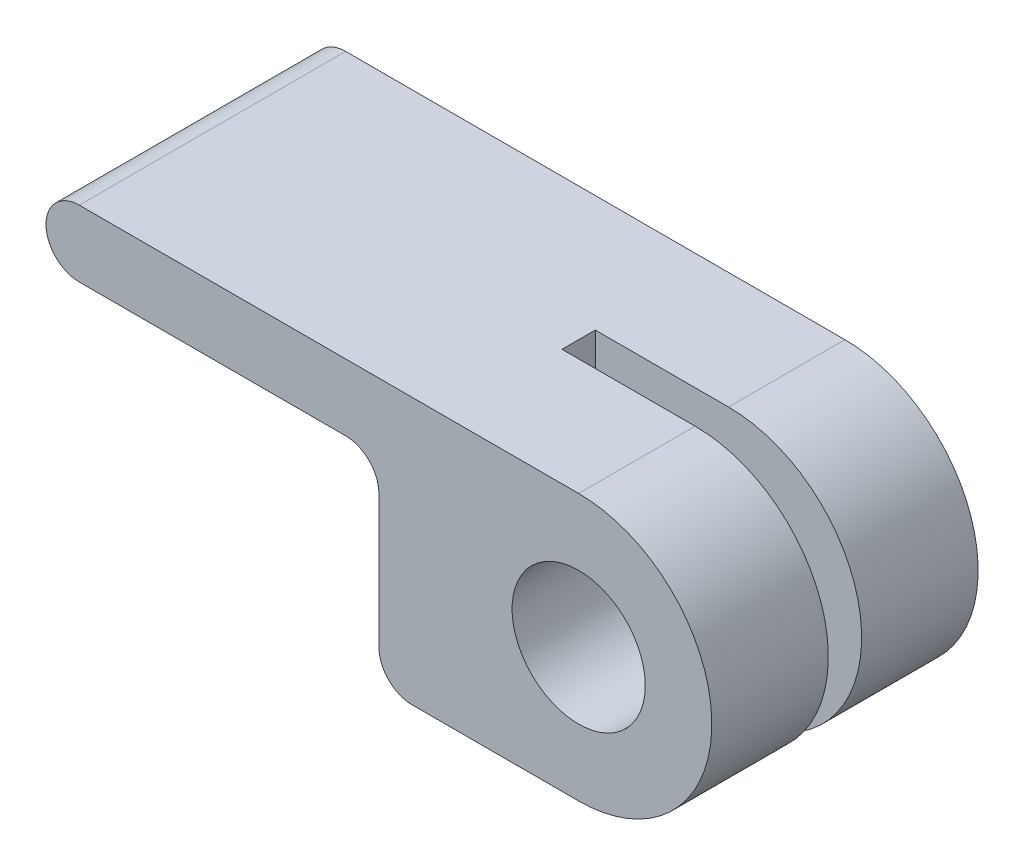
ISO-10303-21;
HEADER;
FILE_DESCRIPTION(('STEP AP214'),'2;1');
FILE_NAME('part.step','',(''),(''),'','','');
FILE_SCHEMA(('AUTOMOTIVE_DESIGN { 1 0 10303 214 1 1 1 1 }'));
ENDSEC;
DATA;
#1=APPLICATION_CONTEXT('core data for automotive mechanical design processes');
#2=APPLICATION_PROTOCOL_DEFINITION('international standard','automotive_design',2000,#1);
#3=PRODUCT_CONTEXT('',#1,'mechanical');
#4=PRODUCT('Part','Part','',(#3));
#5=PRODUCT_RELATED_PRODUCT_CATEGORY('part','',(#4));
#6=PRODUCT_DEFINITION_FORMATION('','',#4);
#7=PRODUCT_DEFINITION_CONTEXT('part definition',#1,'design');
#8=PRODUCT_DEFINITION('design','',#6,#7);
#9=PRODUCT_DEFINITION_SHAPE('','',#8);
#10=(LENGTH_UNIT() NAMED_UNIT(*) SI_UNIT(.MILLI.,.METRE.));
#11=(NAMED_UNIT(*) PLANE_ANGLE_UNIT() SI_UNIT($,.RADIAN.));
#12=(NAMED_UNIT(*) SI_UNIT($,.STERADIAN.) SOLID_ANGLE_UNIT());
#13=UNCERTAINTY_MEASURE_WITH_UNIT(LENGTH_MEASURE(1.E-05),#10,'distance_accuracy_value','');
#14=(GEOMETRIC_REPRESENTATION_CONTEXT(3) GLOBAL_UNCERTAINTY_ASSIGNED_CONTEXT((#13)) GLOBAL_UNIT_ASSIGNED_CONTEXT((#10,
#11,#12)) REPRESENTATION_CONTEXT('',''));
#15=CARTESIAN_POINT('',(0.,0.,0.));
#16=DIRECTION('',(0.,0.,1.));
#17=DIRECTION('',(1.,0.,0.));
#18=AXIS2_PLACEMENT_3D('',#15,#16,#17);
#19=CARTESIAN_POINT('',(0.,-6.35,12.7));
#20=DIRECTION('',(0.,1.,0.));
#21=DIRECTION('',(-1.,0.,0.));
#22=AXIS2_PLACEMENT_3D('',#19,#20,#21);
#23=PLANE('',#22);
#24=DIRECTION('',(1.,0.,0.));
#25=VECTOR('',#24,1.);
#26=CARTESIAN_POINT('',(0.,-6.35,12.7));
#27=LINE('',#26,#25);
#28=CARTESIAN_POINT('',(-7.9375,-6.35,12.7));
#29=VERTEX_POINT('',#28);
#30=CARTESIAN_POINT('',(0.,-6.35,12.7));
#31=VERTEX_POINT('',#30);
#32=EDGE_CURVE('E174',#29,#31,#27,.T.);
#33=ORIENTED_EDGE('',*,*,#32,.F.);
#34=DIRECTION('',(0.,0.,-1.));
#35=VECTOR('',#34,1.);
#36=CARTESIAN_POINT('',(-7.9375,-6.35,12.7));
#37=LINE('',#36,#35);
#38=CARTESIAN_POINT('',(-7.9375,-6.35,0.));
#39=VERTEX_POINT('',#38);
#40=EDGE_CURVE('E225',#29,#39,#37,.T.);
#41=ORIENTED_EDGE('',*,*,#40,.T.);
#42=DIRECTION('',(1.,0.,0.));
#43=VECTOR('',#42,1.);
#44=CARTESIAN_POINT('',(0.,-6.35,0.));
#45=LINE('',#44,#43);
#46=CARTESIAN_POINT('',(0.,-6.35,0.));
#47=VERTEX_POINT('',#46);
#48=EDGE_CURVE('E173',#39,#47,#45,.T.);
#49=ORIENTED_EDGE('',*,*,#48,.T.);
#50=DIRECTION('',(0.,0.,-1.));
#51=VECTOR('',#50,1.);
#52=CARTESIAN_POINT('',(0.,-6.35,12.7));
#53=LINE('',#52,#51);
#54=CARTESIAN_POINT('',(0.,-6.35,5.55625));
#55=VERTEX_POINT('',#54);
#56=EDGE_CURVE('E157',#55,#47,#53,.T.);
#57=ORIENTED_EDGE('',*,*,#56,.F.);
#58=DIRECTION('',(1.,0.,0.));
#59=VECTOR('',#58,1.);
#60=CARTESIAN_POINT('',(6.35,-6.35,5.55625));
#61=LINE('',#60,#59);
#62=CARTESIAN_POINT('',(-6.35,-6.35,5.55625));
#63=VERTEX_POINT('',#62);
#64=EDGE_CURVE('E150',#63,#55,#61,.T.);
#65=ORIENTED_EDGE('',*,*,#64,.F.);
#66=DIRECTION('',(0.,0.,1.));
#67=VECTOR('',#66,1.);
#68=CARTESIAN_POINT('',(-6.35,-6.35,5.55625));
#69=LINE('',#68,#67);
#70=CARTESIAN_POINT('',(-6.35,-6.35,7.14375));
#71=VERTEX_POINT('',#70);
#72=EDGE_CURVE('E134',#63,#71,#69,.T.);
#73=ORIENTED_EDGE('',*,*,#72,.T.);
#74=DIRECTION('',(1.,0.,0.));
#75=VECTOR('',#74,1.);
#76=CARTESIAN_POINT('',(6.35,-6.35,7.14375));
#77=LINE('',#76,#75);
#78=CARTESIAN_POINT('',(0.,-6.35,7.14375));
#79=VERTEX_POINT('',#78);
#80=EDGE_CURVE('E162',#71,#79,#77,.T.);
#81=ORIENTED_EDGE('',*,*,#80,.T.);
#82=EDGE_CURVE('E209',#31,#79,#53,.T.);
#83=ORIENTED_EDGE('',*,*,#82,.F.);
#84=EDGE_LOOP('',(#33,#41,#49,#57,#65,#73,#81,#83));
#85=FACE_BOUND('',#84,.T.);
#86=ADVANCED_FACE('F38',(#85),#23,.F.);
#87=CARTESIAN_POINT('',(0.,0.,12.7));
#88=DIRECTION('',(0.,0.,-1.));
#89=DIRECTION('',(-1.,0.,0.));
#90=AXIS2_PLACEMENT_3D('',#87,#88,#89);
#91=CYLINDRICAL_SURFACE('',#90,6.35);
#92=CARTESIAN_POINT('',(0.,0.,5.55625));
#93=DIRECTION('',(0.,0.,1.));
#94=DIRECTION('',(1.,0.,0.));
#95=AXIS2_PLACEMENT_3D('',#92,#93,#94);
#96=CIRCLE('',#95,6.35);
#97=CARTESIAN_POINT('',(0.,6.35,5.55625));
#98=VERTEX_POINT('',#97);
#99=EDGE_CURVE('E171',#55,#98,#96,.T.);
#100=ORIENTED_EDGE('',*,*,#99,.F.);
#101=ORIENTED_EDGE('',*,*,#56,.T.);
#102=CARTESIAN_POINT('',(0.,0.,0.));
#103=DIRECTION('',(0.,0.,1.));
#104=DIRECTION('',(1.,0.,0.));
#105=AXIS2_PLACEMENT_3D('',#102,#103,#104);
#106=CIRCLE('',#105,6.35);
#107=CARTESIAN_POINT('',(0.,6.35,0.));
#108=VERTEX_POINT('',#107);
#109=EDGE_CURVE('E193',#47,#108,#106,.T.);
#110=ORIENTED_EDGE('',*,*,#109,.T.);
#111=DIRECTION('',(0.,0.,-1.));
#112=VECTOR('',#111,1.);
#113=CARTESIAN_POINT('',(0.,6.35,12.7));
#114=LINE('',#113,#112);
#115=EDGE_CURVE('E191',#98,#108,#114,.T.);
#116=ORIENTED_EDGE('',*,*,#115,.F.);
#117=EDGE_LOOP('',(#100,#101,#110,#116));
#118=FACE_BOUND('',#117,.T.);
#119=ADVANCED_FACE('F289',(#118),#91,.T.);
#120=CARTESIAN_POINT('',(0.,6.35,12.7));
#121=DIRECTION('',(0.,1.,0.));
#122=DIRECTION('',(0.,0.,1.));
#123=AXIS2_PLACEMENT_3D('',#120,#121,#122);
#124=PLANE('',#123);
#125=DIRECTION('',(1.,0.,0.));
#126=VECTOR('',#125,1.);
#127=CARTESIAN_POINT('',(0.,6.35,0.));
#128=LINE('',#127,#126);
#129=CARTESIAN_POINT('',(-23.8125,6.35,0.));
#130=VERTEX_POINT('',#129);
#131=EDGE_CURVE('E196',#130,#108,#128,.T.);
#132=ORIENTED_EDGE('',*,*,#131,.F.);
#133=DIRECTION('',(0.,0.,-1.));
#134=VECTOR('',#133,1.);
#135=CARTESIAN_POINT('',(-23.8125,6.35,12.7));
#136=LINE('',#135,#134);
#137=CARTESIAN_POINT('',(-23.8125,6.35,12.7));
#138=VERTEX_POINT('',#137);
#139=EDGE_CURVE('E239',#130,#138,#136,.F.);
#140=ORIENTED_EDGE('',*,*,#139,.T.);
#141=DIRECTION('',(1.,0.,0.));
#142=VECTOR('',#141,1.);
#143=CARTESIAN_POINT('',(0.,6.35,12.7));
#144=LINE('',#143,#142);
#145=CARTESIAN_POINT('',(0.,6.35,12.7));
#146=VERTEX_POINT('',#145);
#147=EDGE_CURVE('E180',#138,#146,#144,.T.);
#148=ORIENTED_EDGE('',*,*,#147,.T.);
#149=CARTESIAN_POINT('',(0.,6.35,7.14375));
#150=VERTEX_POINT('',#149);
#151=EDGE_CURVE('E206',#146,#150,#114,.T.);
#152=ORIENTED_EDGE('',*,*,#151,.T.);
#153=DIRECTION('',(-1.,0.,0.));
#154=VECTOR('',#153,1.);
#155=CARTESIAN_POINT('',(6.35,6.35,7.14375));
#156=LINE('',#155,#154);
#157=CARTESIAN_POINT('',(-6.35,6.35,7.14375));
#158=VERTEX_POINT('',#157);
#159=EDGE_CURVE('E153',#150,#158,#156,.T.);
#160=ORIENTED_EDGE('',*,*,#159,.T.);
#161=DIRECTION('',(0.,0.,1.));
#162=VECTOR('',#161,1.);
#163=CARTESIAN_POINT('',(-6.35,6.35,5.55625));
#164=LINE('',#163,#162);
#165=CARTESIAN_POINT('',(-6.35,6.35,5.55625));
#166=VERTEX_POINT('',#165);
#167=EDGE_CURVE('E144',#166,#158,#164,.T.);
#168=ORIENTED_EDGE('',*,*,#167,.F.);
#169=DIRECTION('',(-1.,0.,0.));
#170=VECTOR('',#169,1.);
#171=CARTESIAN_POINT('',(6.35,6.35,5.55625));
#172=LINE('',#171,#170);
#173=EDGE_CURVE('E145',#98,#166,#172,.T.);
#174=ORIENTED_EDGE('',*,*,#173,.F.);
#175=ORIENTED_EDGE('',*,*,#115,.T.);
#176=EDGE_LOOP('',(#132,#140,#148,#152,#160,#168,#174,#175));
#177=FACE_BOUND('',#176,.T.);
#178=ADVANCED_FACE('F275',(#177),#124,.T.);
#179=CARTESIAN_POINT('',(0.,0.,12.7));
#180=DIRECTION('',(0.,0.,-1.));
#181=DIRECTION('',(-1.,0.,0.));
#182=AXIS2_PLACEMENT_3D('',#179,#180,#181);
#183=CYLINDRICAL_SURFACE('',#182,3.175);
#184=CARTESIAN_POINT('',(0.,0.,0.));
#185=DIRECTION('',(0.,0.,1.));
#186=DIRECTION('',(1.,0.,0.));
#187=AXIS2_PLACEMENT_3D('',#184,#185,#186);
#188=CIRCLE('',#187,3.175);
#189=CARTESIAN_POINT('',(3.175,0.,0.));
#190=VERTEX_POINT('',#189);
#191=EDGE_CURVE('E177',#190,#190,#188,.T.);
#192=ORIENTED_EDGE('',*,*,#191,.F.);
#193=EDGE_LOOP('',(#192));
#194=FACE_BOUND('',#193,.T.);
#195=CARTESIAN_POINT('',(0.,0.,5.55625));
#196=DIRECTION('',(0.,0.,1.));
#197=DIRECTION('',(1.,0.,0.));
#198=AXIS2_PLACEMENT_3D('',#195,#196,#197);
#199=CIRCLE('',#198,3.175);
#200=CARTESIAN_POINT('',(3.175,0.,5.55625));
#201=VERTEX_POINT('',#200);
#202=EDGE_CURVE('E170',#201,#201,#199,.T.);
#203=ORIENTED_EDGE('',*,*,#202,.T.);
#204=EDGE_LOOP('',(#203));
#205=FACE_BOUND('',#204,.T.);
#206=ADVANCED_FACE('F319',(#194,#205),#183,.F.);
#207=CARTESIAN_POINT('',(0.,0.,7.14375));
#208=DIRECTION('',(0.,0.,1.));
#209=DIRECTION('',(1.,0.,0.));
#210=AXIS2_PLACEMENT_3D('',#207,#208,#209);
#211=CIRCLE('',#210,6.35);
#212=EDGE_CURVE('E168',#79,#150,#211,.T.);
#213=ORIENTED_EDGE('',*,*,#212,.T.);
#214=ORIENTED_EDGE('',*,*,#151,.F.);
#215=CARTESIAN_POINT('',(0.,0.,12.7));
#216=DIRECTION('',(0.,0.,1.));
#217=DIRECTION('',(1.,0.,0.));
#218=AXIS2_PLACEMENT_3D('',#215,#216,#217);
#219=CIRCLE('',#218,6.35);
#220=EDGE_CURVE('E176',#31,#146,#219,.T.);
#221=ORIENTED_EDGE('',*,*,#220,.F.);
#222=ORIENTED_EDGE('',*,*,#82,.T.);
#223=EDGE_LOOP('',(#213,#214,#221,#222));
#224=FACE_BOUND('',#223,.T.);
#225=ADVANCED_FACE('F270',(#224),#91,.T.);
#226=CARTESIAN_POINT('',(0.,3.175,12.7));
#227=DIRECTION('',(0.,-1.,0.));
#228=DIRECTION('',(1.,0.,0.));
#229=AXIS2_PLACEMENT_3D('',#226,#227,#228);
#230=PLANE('',#229);
#231=DIRECTION('',(-1.,0.,0.));
#232=VECTOR('',#231,1.);
#233=CARTESIAN_POINT('',(0.,3.175,0.));
#234=LINE('',#233,#232);
#235=CARTESIAN_POINT('',(-11.1125,3.175,0.));
#236=VERTEX_POINT('',#235);
#237=CARTESIAN_POINT('',(-23.8125,3.175,0.));
#238=VERTEX_POINT('',#237);
#239=EDGE_CURVE('E198',#236,#238,#234,.T.);
#240=ORIENTED_EDGE('',*,*,#239,.F.);
#241=DIRECTION('',(0.,0.,-1.));
#242=VECTOR('',#241,1.);
#243=CARTESIAN_POINT('',(-11.1125,3.175,12.7));
#244=LINE('',#243,#242);
#245=CARTESIAN_POINT('',(-11.1125,3.175,12.7));
#246=VERTEX_POINT('',#245);
#247=EDGE_CURVE('E223',#236,#246,#244,.F.);
#248=ORIENTED_EDGE('',*,*,#247,.T.);
#249=DIRECTION('',(-1.,0.,0.));
#250=VECTOR('',#249,1.);
#251=CARTESIAN_POINT('',(0.,3.175,12.7));
#252=LINE('',#251,#250);
#253=CARTESIAN_POINT('',(-23.8125,3.175,12.7));
#254=VERTEX_POINT('',#253);
#255=EDGE_CURVE('E182',#246,#254,#252,.T.);
#256=ORIENTED_EDGE('',*,*,#255,.T.);
#257=DIRECTION('',(0.,0.,-1.));
#258=VECTOR('',#257,1.);
#259=CARTESIAN_POINT('',(-23.8125,3.175,12.7));
#260=LINE('',#259,#258);
#261=EDGE_CURVE('E221',#254,#238,#260,.T.);
#262=ORIENTED_EDGE('',*,*,#261,.T.);
#263=EDGE_LOOP('',(#240,#248,#256,#262));
#264=FACE_BOUND('',#263,.T.);
#265=ADVANCED_FACE('F252',(#264),#230,.T.);
#266=CARTESIAN_POINT('',(-9.525,0.,12.7));
#267=DIRECTION('',(1.,0.,0.));
#268=DIRECTION('',(0.,0.,-1.));
#269=AXIS2_PLACEMENT_3D('',#266,#267,#268);
#270=PLANE('',#269);
#271=DIRECTION('',(0.,-1.,0.));
#272=VECTOR('',#271,1.);
#273=CARTESIAN_POINT('',(-9.525,0.,12.7));
#274=LINE('',#273,#272);
#275=CARTESIAN_POINT('',(-9.525,1.5875,12.7));
#276=VERTEX_POINT('',#275);
#277=CARTESIAN_POINT('',(-9.525,-4.7625,12.7));
#278=VERTEX_POINT('',#277);
#279=EDGE_CURVE('E185',#276,#278,#274,.T.);
#280=ORIENTED_EDGE('',*,*,#279,.F.);
#281=DIRECTION('',(0.,0.,-1.));
#282=VECTOR('',#281,1.);
#283=CARTESIAN_POINT('',(-9.525,1.5875,12.7));
#284=LINE('',#283,#282);
#285=CARTESIAN_POINT('',(-9.525,1.5875,0.));
#286=VERTEX_POINT('',#285);
#287=EDGE_CURVE('E218',#276,#286,#284,.T.);
#288=ORIENTED_EDGE('',*,*,#287,.T.);
#289=DIRECTION('',(0.,-1.,0.));
#290=VECTOR('',#289,1.);
#291=CARTESIAN_POINT('',(-9.525,0.,0.));
#292=LINE('',#291,#290);
#293=CARTESIAN_POINT('',(-9.525,-4.7625,0.));
#294=VERTEX_POINT('',#293);
#295=EDGE_CURVE('E201',#286,#294,#292,.T.);
#296=ORIENTED_EDGE('',*,*,#295,.T.);
#297=DIRECTION('',(0.,0.,-1.));
#298=VECTOR('',#297,1.);
#299=CARTESIAN_POINT('',(-9.525,-4.7625,12.7));
#300=LINE('',#299,#298);
#301=EDGE_CURVE('E212',#294,#278,#300,.F.);
#302=ORIENTED_EDGE('',*,*,#301,.T.);
#303=EDGE_LOOP('',(#280,#288,#296,#302));
#304=FACE_BOUND('',#303,.T.);
#305=ADVANCED_FACE('F262',(#304),#270,.F.);
#306=CARTESIAN_POINT('',(0.,0.,7.14375));
#307=DIRECTION('',(0.,0.,1.));
#308=DIRECTION('',(1.,0.,0.));
#309=AXIS2_PLACEMENT_3D('',#306,#307,#308);
#310=CIRCLE('',#309,3.175);
#311=CARTESIAN_POINT('',(3.175,0.,7.14375));
#312=VERTEX_POINT('',#311);
#313=EDGE_CURVE('E166',#312,#312,#310,.T.);
#314=ORIENTED_EDGE('',*,*,#313,.F.);
#315=EDGE_LOOP('',(#314));
#316=FACE_BOUND('',#315,.T.);
#317=CARTESIAN_POINT('',(0.,0.,12.7));
#318=DIRECTION('',(0.,0.,1.));
#319=DIRECTION('',(1.,0.,0.));
#320=AXIS2_PLACEMENT_3D('',#317,#318,#319);
#321=CIRCLE('',#320,3.175);
#322=CARTESIAN_POINT('',(3.175,0.,12.7));
#323=VERTEX_POINT('',#322);
#324=EDGE_CURVE('E188',#323,#323,#321,.T.);
#325=ORIENTED_EDGE('',*,*,#324,.T.);
#326=EDGE_LOOP('',(#325));
#327=FACE_BOUND('',#326,.T.);
#328=ADVANCED_FACE('F313',(#316,#327),#183,.F.);
#329=CARTESIAN_POINT('',(0.,0.,12.7));
#330=DIRECTION('',(0.,0.,1.));
#331=DIRECTION('',(1.,0.,0.));
#332=AXIS2_PLACEMENT_3D('',#329,#330,#331);
#333=PLANE('',#332);
#334=ORIENTED_EDGE('',*,*,#279,.T.);
#335=CARTESIAN_POINT('',(-7.9375,-4.7625,12.7));
#336=DIRECTION('',(0.,0.,1.));
#337=DIRECTION('',(1.,0.,0.));
#338=AXIS2_PLACEMENT_3D('',#335,#336,#337);
#339=CIRCLE('',#338,1.5875);
#340=EDGE_CURVE('E237',#278,#29,#339,.T.);
#341=ORIENTED_EDGE('',*,*,#340,.T.);
#342=ORIENTED_EDGE('',*,*,#32,.T.);
#343=ORIENTED_EDGE('',*,*,#220,.T.);
#344=ORIENTED_EDGE('',*,*,#147,.F.);
#345=CARTESIAN_POINT('',(-23.8125,4.7625,12.7));
#346=DIRECTION('',(0.,0.,1.));
#347=DIRECTION('',(1.,0.,0.));
#348=AXIS2_PLACEMENT_3D('',#345,#346,#347);
#349=CIRCLE('',#348,1.5875);
#350=CARTESIAN_POINT('',(-25.4,4.7625,12.7));
#351=VERTEX_POINT('',#350);
#352=EDGE_CURVE('E54',#138,#351,#349,.T.);
#353=ORIENTED_EDGE('',*,*,#352,.T.);
#354=CARTESIAN_POINT('',(-23.8125,4.7625,12.7));
#355=DIRECTION('',(0.,0.,1.));
#356=DIRECTION('',(1.,0.,0.));
#357=AXIS2_PLACEMENT_3D('',#354,#355,#356);
#358=CIRCLE('',#357,1.5875);
#359=EDGE_CURVE('E234',#351,#254,#358,.T.);
#360=ORIENTED_EDGE('',*,*,#359,.T.);
#361=ORIENTED_EDGE('',*,*,#255,.F.);
#362=CARTESIAN_POINT('',(-11.1125,1.5875,12.7));
#363=DIRECTION('',(0.,0.,1.));
#364=DIRECTION('',(1.,0.,0.));
#365=AXIS2_PLACEMENT_3D('',#362,#363,#364);
#366=CIRCLE('',#365,1.5875);
#367=EDGE_CURVE('E11',#246,#276,#366,.F.);
#368=ORIENTED_EDGE('',*,*,#367,.T.);
#369=EDGE_LOOP('',(#334,#341,#342,#343,#344,#353,#360,#361,#368));
#370=FACE_BOUND('',#369,.T.);
#371=ORIENTED_EDGE('',*,*,#324,.F.);
#372=EDGE_LOOP('',(#371));
#373=FACE_BOUND('',#372,.T.);
#374=ADVANCED_FACE('F258',(#370,#373),#333,.T.);
#375=CARTESIAN_POINT('',(0.,0.,0.));
#376=DIRECTION('',(0.,0.,1.));
#377=DIRECTION('',(1.,0.,0.));
#378=AXIS2_PLACEMENT_3D('',#375,#376,#377);
#379=PLANE('',#378);
#380=ORIENTED_EDGE('',*,*,#48,.F.);
#381=CARTESIAN_POINT('',(-7.9375,-4.7625,0.));
#382=DIRECTION('',(0.,0.,1.));
#383=DIRECTION('',(1.,0.,0.));
#384=AXIS2_PLACEMENT_3D('',#381,#382,#383);
#385=CIRCLE('',#384,1.5875);
#386=EDGE_CURVE('E232',#39,#294,#385,.F.);
#387=ORIENTED_EDGE('',*,*,#386,.T.);
#388=ORIENTED_EDGE('',*,*,#295,.F.);
#389=CARTESIAN_POINT('',(-11.1125,1.5875,0.));
#390=DIRECTION('',(0.,0.,1.));
#391=DIRECTION('',(1.,0.,0.));
#392=AXIS2_PLACEMENT_3D('',#389,#390,#391);
#393=CIRCLE('',#392,1.5875);
#394=EDGE_CURVE('E47',#286,#236,#393,.T.);
#395=ORIENTED_EDGE('',*,*,#394,.T.);
#396=ORIENTED_EDGE('',*,*,#239,.T.);
#397=CARTESIAN_POINT('',(-23.8125,4.7625,0.));
#398=DIRECTION('',(0.,0.,1.));
#399=DIRECTION('',(1.,0.,0.));
#400=AXIS2_PLACEMENT_3D('',#397,#398,#399);
#401=CIRCLE('',#400,1.5875);
#402=CARTESIAN_POINT('',(-25.4,4.7625,0.));
#403=VERTEX_POINT('',#402);
#404=EDGE_CURVE('E228',#238,#403,#401,.F.);
#405=ORIENTED_EDGE('',*,*,#404,.T.);
#406=CARTESIAN_POINT('',(-23.8125,4.7625,0.));
#407=DIRECTION('',(0.,0.,1.));
#408=DIRECTION('',(1.,0.,0.));
#409=AXIS2_PLACEMENT_3D('',#406,#407,#408);
#410=CIRCLE('',#409,1.5875);
#411=EDGE_CURVE('E230',#403,#130,#410,.F.);
#412=ORIENTED_EDGE('',*,*,#411,.T.);
#413=ORIENTED_EDGE('',*,*,#131,.T.);
#414=ORIENTED_EDGE('',*,*,#109,.F.);
#415=EDGE_LOOP('',(#380,#387,#388,#395,#396,#405,#412,#413,#414));
#416=FACE_BOUND('',#415,.T.);
#417=ORIENTED_EDGE('',*,*,#191,.T.);
#418=EDGE_LOOP('',(#417));
#419=FACE_BOUND('',#418,.T.);
#420=ADVANCED_FACE('F245',(#416,#419),#379,.F.);
#421=CARTESIAN_POINT('',(0.,0.,5.55625));
#422=DIRECTION('',(0.,0.,1.));
#423=DIRECTION('',(1.,0.,0.));
#424=AXIS2_PLACEMENT_3D('',#421,#422,#423);
#425=PLANE('',#424);
#426=ORIENTED_EDGE('',*,*,#202,.F.);
#427=EDGE_LOOP('',(#426));
#428=FACE_BOUND('',#427,.T.);
#429=ORIENTED_EDGE('',*,*,#99,.T.);
#430=ORIENTED_EDGE('',*,*,#173,.T.);
#431=DIRECTION('',(0.,-1.,0.));
#432=VECTOR('',#431,1.);
#433=CARTESIAN_POINT('',(-6.35,-6.35,5.55625));
#434=LINE('',#433,#432);
#435=EDGE_CURVE('E138',#166,#63,#434,.T.);
#436=ORIENTED_EDGE('',*,*,#435,.T.);
#437=ORIENTED_EDGE('',*,*,#64,.T.);
#438=EDGE_LOOP('',(#429,#430,#436,#437));
#439=FACE_BOUND('',#438,.T.);
#440=ADVANCED_FACE('F149',(#428,#439),#425,.T.);
#441=CARTESIAN_POINT('',(0.,0.,7.14375));
#442=DIRECTION('',(0.,0.,1.));
#443=DIRECTION('',(1.,0.,0.));
#444=AXIS2_PLACEMENT_3D('',#441,#442,#443);
#445=PLANE('',#444);
#446=ORIENTED_EDGE('',*,*,#313,.T.);
#447=EDGE_LOOP('',(#446));
#448=FACE_BOUND('',#447,.T.);
#449=ORIENTED_EDGE('',*,*,#212,.F.);
#450=ORIENTED_EDGE('',*,*,#80,.F.);
#451=DIRECTION('',(0.,-1.,0.));
#452=VECTOR('',#451,1.);
#453=CARTESIAN_POINT('',(-6.35,-6.35,7.14375));
#454=LINE('',#453,#452);
#455=EDGE_CURVE('E140',#158,#71,#454,.T.);
#456=ORIENTED_EDGE('',*,*,#455,.F.);
#457=ORIENTED_EDGE('',*,*,#159,.F.);
#458=EDGE_LOOP('',(#449,#450,#456,#457));
#459=FACE_BOUND('',#458,.T.);
#460=ADVANCED_FACE('F302',(#448,#459),#445,.F.);
#461=CARTESIAN_POINT('',(-6.35,-6.35,5.55625));
#462=DIRECTION('',(-1.,0.,0.));
#463=DIRECTION('',(0.,0.,1.));
#464=AXIS2_PLACEMENT_3D('',#461,#462,#463);
#465=PLANE('',#464);
#466=ORIENTED_EDGE('',*,*,#455,.T.);
#467=ORIENTED_EDGE('',*,*,#72,.F.);
#468=ORIENTED_EDGE('',*,*,#435,.F.);
#469=ORIENTED_EDGE('',*,*,#167,.T.);
#470=EDGE_LOOP('',(#466,#467,#468,#469));
#471=FACE_BOUND('',#470,.T.);
#472=ADVANCED_FACE('F136',(#471),#465,.F.);
#473=CARTESIAN_POINT('',(-11.1125,1.5875,12.7));
#474=DIRECTION('',(0.,0.,-1.));
#475=DIRECTION('',(-1.,0.,0.));
#476=AXIS2_PLACEMENT_3D('',#473,#474,#475);
#477=CYLINDRICAL_SURFACE('',#476,1.5875);
#478=ORIENTED_EDGE('',*,*,#367,.F.);
#479=ORIENTED_EDGE('',*,*,#247,.F.);
#480=ORIENTED_EDGE('',*,*,#394,.F.);
#481=ORIENTED_EDGE('',*,*,#287,.F.);
#482=EDGE_LOOP('',(#478,#479,#480,#481));
#483=FACE_BOUND('',#482,.T.);
#484=ADVANCED_FACE('F256',(#483),#477,.F.);
#485=CARTESIAN_POINT('',(-7.9375,-4.7625,12.7));
#486=DIRECTION('',(0.,0.,-1.));
#487=DIRECTION('',(-1.,0.,0.));
#488=AXIS2_PLACEMENT_3D('',#485,#486,#487);
#489=CYLINDRICAL_SURFACE('',#488,1.5875);
#490=ORIENTED_EDGE('',*,*,#340,.F.);
#491=ORIENTED_EDGE('',*,*,#301,.F.);
#492=ORIENTED_EDGE('',*,*,#386,.F.);
#493=ORIENTED_EDGE('',*,*,#40,.F.);
#494=EDGE_LOOP('',(#490,#491,#492,#493));
#495=FACE_BOUND('',#494,.T.);
#496=ADVANCED_FACE('F265',(#495),#489,.T.);
#497=CARTESIAN_POINT('',(-23.8125,4.7625,12.7));
#498=DIRECTION('',(0.,0.,-1.));
#499=DIRECTION('',(-1.,0.,0.));
#500=AXIS2_PLACEMENT_3D('',#497,#498,#499);
#501=CYLINDRICAL_SURFACE('',#500,1.5875);
#502=ORIENTED_EDGE('',*,*,#261,.F.);
#503=ORIENTED_EDGE('',*,*,#359,.F.);
#504=DIRECTION('',(0.,0.,-1.));
#505=VECTOR('',#504,1.);
#506=CARTESIAN_POINT('',(-25.4,4.7625,12.7));
#507=LINE('',#506,#505);
#508=EDGE_CURVE('E42',#403,#351,#507,.F.);
#509=ORIENTED_EDGE('',*,*,#508,.F.);
#510=ORIENTED_EDGE('',*,*,#404,.F.);
#511=EDGE_LOOP('',(#502,#503,#509,#510));
#512=FACE_BOUND('',#511,.T.);
#513=ADVANCED_FACE('F40',(#512),#501,.T.);
#514=CARTESIAN_POINT('',(-23.8125,4.7625,12.7));
#515=DIRECTION('',(0.,0.,-1.));
#516=DIRECTION('',(-1.,0.,0.));
#517=AXIS2_PLACEMENT_3D('',#514,#515,#516);
#518=CYLINDRICAL_SURFACE('',#517,1.5875);
#519=ORIENTED_EDGE('',*,*,#352,.F.);
#520=ORIENTED_EDGE('',*,*,#139,.F.);
#521=ORIENTED_EDGE('',*,*,#411,.F.);
#522=ORIENTED_EDGE('',*,*,#508,.T.);
#523=EDGE_LOOP('',(#519,#520,#521,#522));
#524=FACE_BOUND('',#523,.T.);
#525=ADVANCED_FACE('F278',(#524),#518,.T.);
#526=CLOSED_SHELL('',(#86,#119,#178,#206,#225,#265,#305,#328,#374,#420,#440,#460,#472,#484,#496,
#513,#525));
#527=MANIFOLD_SOLID_BREP('B2',#526);
#528=ADVANCED_BREP_SHAPE_REPRESENTATION('',(#18,#527),#14);
#529=SHAPE_DEFINITION_REPRESENTATION(#9,#528);
ENDSEC;
END-ISO-10303-21;
